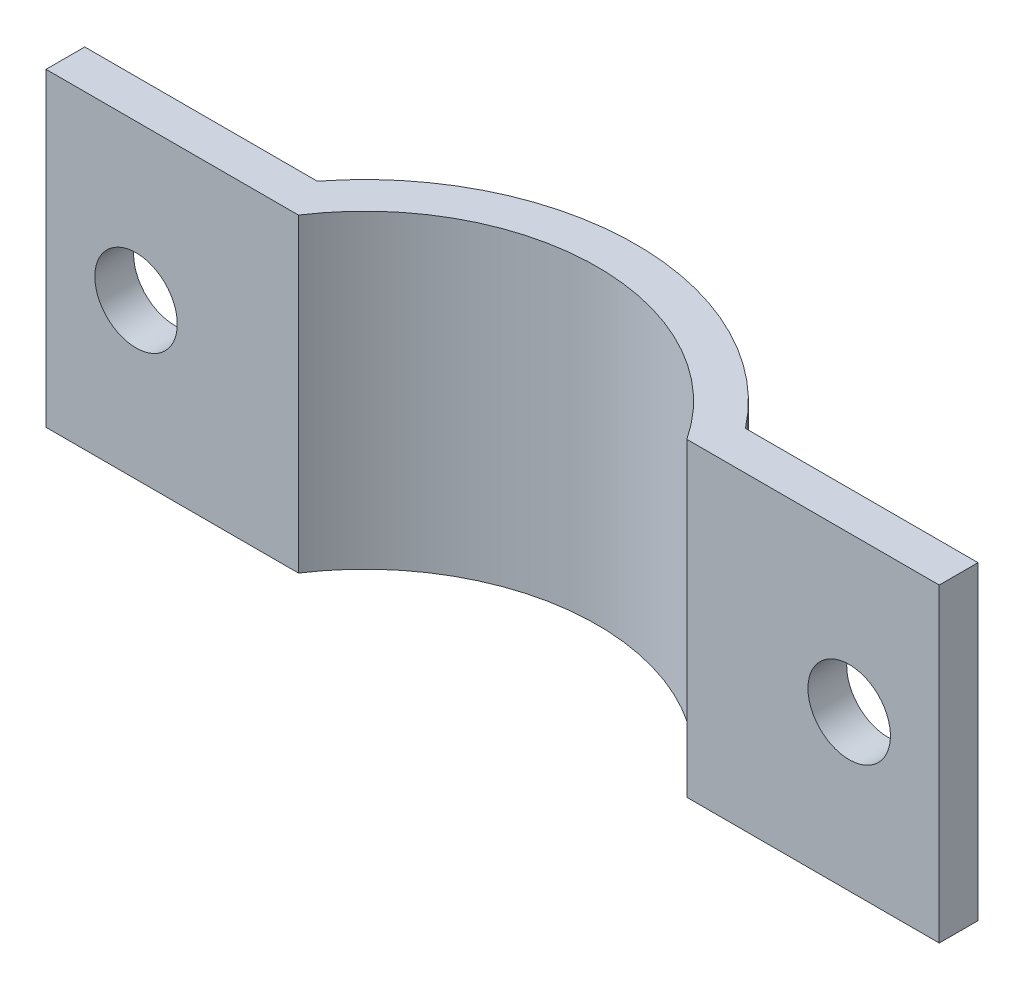
ISO-10303-21;
HEADER;
FILE_DESCRIPTION(('STEP AP214'),'2;1');
FILE_NAME('part.step','',(''),(''),'','','');
FILE_SCHEMA(('AUTOMOTIVE_DESIGN { 1 0 10303 214 1 1 1 1 }'));
ENDSEC;
DATA;
#1=APPLICATION_CONTEXT('core data for automotive mechanical design processes');
#2=APPLICATION_PROTOCOL_DEFINITION('international standard','automotive_design',2000,#1);
#3=PRODUCT_CONTEXT('',#1,'mechanical');
#4=PRODUCT('Part','Part','',(#3));
#5=PRODUCT_RELATED_PRODUCT_CATEGORY('part','',(#4));
#6=PRODUCT_DEFINITION_FORMATION('','',#4);
#7=PRODUCT_DEFINITION_CONTEXT('part definition',#1,'design');
#8=PRODUCT_DEFINITION('design','',#6,#7);
#9=PRODUCT_DEFINITION_SHAPE('','',#8);
#10=(LENGTH_UNIT() NAMED_UNIT(*) SI_UNIT(.MILLI.,.METRE.));
#11=(NAMED_UNIT(*) PLANE_ANGLE_UNIT() SI_UNIT($,.RADIAN.));
#12=(NAMED_UNIT(*) SI_UNIT($,.STERADIAN.) SOLID_ANGLE_UNIT());
#13=UNCERTAINTY_MEASURE_WITH_UNIT(LENGTH_MEASURE(1.E-05),#10,'distance_accuracy_value','');
#14=(GEOMETRIC_REPRESENTATION_CONTEXT(3) GLOBAL_UNCERTAINTY_ASSIGNED_CONTEXT((#13)) GLOBAL_UNIT_ASSIGNED_CONTEXT((#10,
#11,#12)) REPRESENTATION_CONTEXT('',''));
#15=CARTESIAN_POINT('',(0.,0.,0.));
#16=DIRECTION('',(0.,0.,1.));
#17=DIRECTION('',(1.,0.,0.));
#18=AXIS2_PLACEMENT_3D('',#15,#16,#17);
#19=CARTESIAN_POINT('',(0.,25.4,0.));
#20=DIRECTION('',(0.,1.,0.));
#21=DIRECTION('',(0.,0.,1.));
#22=AXIS2_PLACEMENT_3D('',#19,#20,#21);
#23=PLANE('',#22);
#24=DIRECTION('',(-1.,0.,0.));
#25=VECTOR('',#24,1.);
#26=CARTESIAN_POINT('',(42.4748584615149,25.4,-10.4775));
#27=LINE('',#26,#25);
#28=CARTESIAN_POINT('',(36.5873848891447,25.4,-10.4775));
#29=VERTEX_POINT('',#28);
#30=CARTESIAN_POINT('',(15.9098866667868,25.4,-10.4775));
#31=VERTEX_POINT('',#30);
#32=EDGE_CURVE('E56',#29,#31,#27,.T.);
#33=ORIENTED_EDGE('',*,*,#32,.F.);
#34=DIRECTION('',(0.,0.,-1.));
#35=VECTOR('',#34,1.);
#36=CARTESIAN_POINT('',(36.5873848891447,25.4,-13.6525));
#37=LINE('',#36,#35);
#38=CARTESIAN_POINT('',(36.5873848891447,25.4,-13.6525));
#39=VERTEX_POINT('',#38);
#40=EDGE_CURVE('E108',#29,#39,#37,.T.);
#41=ORIENTED_EDGE('',*,*,#40,.T.);
#42=DIRECTION('',(-1.,0.,0.));
#43=VECTOR('',#42,1.);
#44=CARTESIAN_POINT('',(36.5873848891447,25.4,-13.6525));
#45=LINE('',#44,#43);
#46=CARTESIAN_POINT('',(17.5373848891447,25.4,-13.6525));
#47=VERTEX_POINT('',#46);
#48=EDGE_CURVE('E116',#39,#47,#45,.T.);
#49=ORIENTED_EDGE('',*,*,#48,.T.);
#50=CARTESIAN_POINT('',(0.,25.4,0.));
#51=DIRECTION('',(0.,1.,0.));
#52=DIRECTION('',(0.,0.,1.));
#53=AXIS2_PLACEMENT_3D('',#50,#51,#52);
#54=CIRCLE('',#53,22.225);
#55=CARTESIAN_POINT('',(-17.5373848891447,25.4,-13.6525));
#56=VERTEX_POINT('',#55);
#57=EDGE_CURVE('E119',#47,#56,#54,.T.);
#58=ORIENTED_EDGE('',*,*,#57,.T.);
#59=DIRECTION('',(-1.,0.,0.));
#60=VECTOR('',#59,1.);
#61=CARTESIAN_POINT('',(-17.5373848891447,25.4,-13.6525));
#62=LINE('',#61,#60);
#63=CARTESIAN_POINT('',(-36.5873848891447,25.4,-13.6525));
#64=VERTEX_POINT('',#63);
#65=EDGE_CURVE('E129',#56,#64,#62,.T.);
#66=ORIENTED_EDGE('',*,*,#65,.T.);
#67=DIRECTION('',(0.,0.,1.));
#68=VECTOR('',#67,1.);
#69=CARTESIAN_POINT('',(-36.5873848891447,25.4,-13.6525));
#70=LINE('',#69,#68);
#71=CARTESIAN_POINT('',(-36.5873848891447,25.4,-10.4775));
#72=VERTEX_POINT('',#71);
#73=EDGE_CURVE('E131',#64,#72,#70,.T.);
#74=ORIENTED_EDGE('',*,*,#73,.T.);
#75=CARTESIAN_POINT('',(-15.9098866667868,25.4,-10.4775));
#76=VERTEX_POINT('',#75);
#77=EDGE_CURVE('E113',#76,#72,#27,.T.);
#78=ORIENTED_EDGE('',*,*,#77,.F.);
#79=CARTESIAN_POINT('',(0.,25.4,0.));
#80=DIRECTION('',(0.,1.,0.));
#81=DIRECTION('',(0.,0.,1.));
#82=AXIS2_PLACEMENT_3D('',#79,#80,#81);
#83=CIRCLE('',#82,19.05);
#84=EDGE_CURVE('E112',#31,#76,#83,.T.);
#85=ORIENTED_EDGE('',*,*,#84,.F.);
#86=EDGE_LOOP('',(#33,#41,#49,#58,#66,#74,#78,#85));
#87=FACE_BOUND('',#86,.T.);
#88=ADVANCED_FACE('F32',(#87),#23,.T.);
#89=CARTESIAN_POINT('',(0.,0.,0.));
#90=DIRECTION('',(0.,1.,0.));
#91=DIRECTION('',(0.,0.,1.));
#92=AXIS2_PLACEMENT_3D('',#89,#90,#91);
#93=PLANE('',#92);
#94=DIRECTION('',(0.,0.,-1.));
#95=VECTOR('',#94,1.);
#96=CARTESIAN_POINT('',(36.5873848891447,0.,-13.6525));
#97=LINE('',#96,#95);
#98=CARTESIAN_POINT('',(36.5873848891447,0.,-10.4775));
#99=VERTEX_POINT('',#98);
#100=CARTESIAN_POINT('',(36.5873848891447,0.,-13.6525));
#101=VERTEX_POINT('',#100);
#102=EDGE_CURVE('E135',#99,#101,#97,.T.);
#103=ORIENTED_EDGE('',*,*,#102,.F.);
#104=DIRECTION('',(-1.,0.,0.));
#105=VECTOR('',#104,1.);
#106=CARTESIAN_POINT('',(42.4748584615149,0.,-10.4775));
#107=LINE('',#106,#105);
#108=CARTESIAN_POINT('',(15.9098866667868,0.,-10.4775));
#109=VERTEX_POINT('',#108);
#110=EDGE_CURVE('E99',#99,#109,#107,.T.);
#111=ORIENTED_EDGE('',*,*,#110,.T.);
#112=CARTESIAN_POINT('',(0.,0.,0.));
#113=DIRECTION('',(0.,1.,0.));
#114=DIRECTION('',(0.,0.,1.));
#115=AXIS2_PLACEMENT_3D('',#112,#113,#114);
#116=CIRCLE('',#115,19.05);
#117=CARTESIAN_POINT('',(-15.9098866667868,0.,-10.4775));
#118=VERTEX_POINT('',#117);
#119=EDGE_CURVE('E125',#109,#118,#116,.T.);
#120=ORIENTED_EDGE('',*,*,#119,.T.);
#121=CARTESIAN_POINT('',(-36.5873848891447,0.,-10.4775));
#122=VERTEX_POINT('',#121);
#123=EDGE_CURVE('E48',#118,#122,#107,.T.);
#124=ORIENTED_EDGE('',*,*,#123,.T.);
#125=DIRECTION('',(0.,0.,1.));
#126=VECTOR('',#125,1.);
#127=CARTESIAN_POINT('',(-36.5873848891447,0.,-13.6525));
#128=LINE('',#127,#126);
#129=CARTESIAN_POINT('',(-36.5873848891447,0.,-13.6525));
#130=VERTEX_POINT('',#129);
#131=EDGE_CURVE('E117',#130,#122,#128,.T.);
#132=ORIENTED_EDGE('',*,*,#131,.F.);
#133=DIRECTION('',(-1.,0.,0.));
#134=VECTOR('',#133,1.);
#135=CARTESIAN_POINT('',(-17.5373848891447,0.,-13.6525));
#136=LINE('',#135,#134);
#137=CARTESIAN_POINT('',(-17.5373848891447,0.,-13.6525));
#138=VERTEX_POINT('',#137);
#139=EDGE_CURVE('E122',#138,#130,#136,.T.);
#140=ORIENTED_EDGE('',*,*,#139,.F.);
#141=CARTESIAN_POINT('',(0.,0.,0.));
#142=DIRECTION('',(0.,1.,0.));
#143=DIRECTION('',(0.,0.,1.));
#144=AXIS2_PLACEMENT_3D('',#141,#142,#143);
#145=CIRCLE('',#144,22.225);
#146=CARTESIAN_POINT('',(17.5373848891447,0.,-13.6525));
#147=VERTEX_POINT('',#146);
#148=EDGE_CURVE('E139',#147,#138,#145,.T.);
#149=ORIENTED_EDGE('',*,*,#148,.F.);
#150=DIRECTION('',(-1.,0.,0.));
#151=VECTOR('',#150,1.);
#152=CARTESIAN_POINT('',(36.5873848891447,0.,-13.6525));
#153=LINE('',#152,#151);
#154=EDGE_CURVE('E137',#101,#147,#153,.T.);
#155=ORIENTED_EDGE('',*,*,#154,.F.);
#156=EDGE_LOOP('',(#103,#111,#120,#124,#132,#140,#149,#155));
#157=FACE_BOUND('',#156,.T.);
#158=ADVANCED_FACE('F158',(#157),#93,.F.);
#159=CARTESIAN_POINT('',(36.5873848891447,25.4,-13.6525));
#160=DIRECTION('',(-1.,0.,0.));
#161=DIRECTION('',(0.,0.,1.));
#162=AXIS2_PLACEMENT_3D('',#159,#160,#161);
#163=PLANE('',#162);
#164=ORIENTED_EDGE('',*,*,#40,.F.);
#165=DIRECTION('',(0.,-1.,0.));
#166=VECTOR('',#165,1.);
#167=CARTESIAN_POINT('',(36.5873848891447,25.4,-10.4775));
#168=LINE('',#167,#166);
#169=EDGE_CURVE('E96',#29,#99,#168,.T.);
#170=ORIENTED_EDGE('',*,*,#169,.T.);
#171=ORIENTED_EDGE('',*,*,#102,.T.);
#172=DIRECTION('',(0.,-1.,0.));
#173=VECTOR('',#172,1.);
#174=CARTESIAN_POINT('',(36.5873848891447,25.4,-13.6525));
#175=LINE('',#174,#173);
#176=EDGE_CURVE('E11',#39,#101,#175,.T.);
#177=ORIENTED_EDGE('',*,*,#176,.F.);
#178=EDGE_LOOP('',(#164,#170,#171,#177));
#179=FACE_BOUND('',#178,.T.);
#180=ADVANCED_FACE('F34',(#179),#163,.F.);
#181=CARTESIAN_POINT('',(36.5873848891447,25.4,-13.6525));
#182=DIRECTION('',(0.,0.,1.));
#183=DIRECTION('',(1.,0.,0.));
#184=AXIS2_PLACEMENT_3D('',#181,#182,#183);
#185=PLANE('',#184);
#186=CARTESIAN_POINT('',(29.21,12.7,-13.6525));
#187=DIRECTION('',(0.,0.,-1.));
#188=DIRECTION('',(1.,0.,0.));
#189=AXIS2_PLACEMENT_3D('',#186,#187,#188);
#190=CIRCLE('',#189,3.3782);
#191=CARTESIAN_POINT('',(32.5882,12.7,-13.6525));
#192=VERTEX_POINT('',#191);
#193=EDGE_CURVE('E103',#192,#192,#190,.T.);
#194=ORIENTED_EDGE('',*,*,#193,.F.);
#195=EDGE_LOOP('',(#194));
#196=FACE_BOUND('',#195,.T.);
#197=ORIENTED_EDGE('',*,*,#154,.T.);
#198=DIRECTION('',(0.,-1.,0.));
#199=VECTOR('',#198,1.);
#200=CARTESIAN_POINT('',(17.5373848891447,25.4,-13.6525));
#201=LINE('',#200,#199);
#202=EDGE_CURVE('E41',#47,#147,#201,.T.);
#203=ORIENTED_EDGE('',*,*,#202,.F.);
#204=ORIENTED_EDGE('',*,*,#48,.F.);
#205=ORIENTED_EDGE('',*,*,#176,.T.);
#206=EDGE_LOOP('',(#197,#203,#204,#205));
#207=FACE_BOUND('',#206,.T.);
#208=ADVANCED_FACE('F168',(#196,#207),#185,.F.);
#209=CARTESIAN_POINT('',(0.,25.4,0.));
#210=DIRECTION('',(0.,-1.,0.));
#211=DIRECTION('',(0.,0.,-1.));
#212=AXIS2_PLACEMENT_3D('',#209,#210,#211);
#213=CYLINDRICAL_SURFACE('',#212,22.225);
#214=ORIENTED_EDGE('',*,*,#148,.T.);
#215=DIRECTION('',(0.,-1.,0.));
#216=VECTOR('',#215,1.);
#217=CARTESIAN_POINT('',(-17.5373848891447,25.4,-13.6525));
#218=LINE('',#217,#216);
#219=EDGE_CURVE('E144',#56,#138,#218,.T.);
#220=ORIENTED_EDGE('',*,*,#219,.F.);
#221=ORIENTED_EDGE('',*,*,#57,.F.);
#222=ORIENTED_EDGE('',*,*,#202,.T.);
#223=EDGE_LOOP('',(#214,#220,#221,#222));
#224=FACE_BOUND('',#223,.T.);
#225=ADVANCED_FACE('F152',(#224),#213,.T.);
#226=CARTESIAN_POINT('',(-17.5373848891447,25.4,-13.6525));
#227=DIRECTION('',(0.,0.,1.));
#228=DIRECTION('',(1.,0.,0.));
#229=AXIS2_PLACEMENT_3D('',#226,#227,#228);
#230=PLANE('',#229);
#231=CARTESIAN_POINT('',(-29.21,12.7,-13.6525));
#232=DIRECTION('',(0.,0.,-1.));
#233=DIRECTION('',(-1.,0.,0.));
#234=AXIS2_PLACEMENT_3D('',#231,#232,#233);
#235=CIRCLE('',#234,3.3782);
#236=CARTESIAN_POINT('',(-32.5882,12.7,-13.6525));
#237=VERTEX_POINT('',#236);
#238=EDGE_CURVE('E195',#237,#237,#235,.T.);
#239=ORIENTED_EDGE('',*,*,#238,.F.);
#240=EDGE_LOOP('',(#239));
#241=FACE_BOUND('',#240,.T.);
#242=ORIENTED_EDGE('',*,*,#139,.T.);
#243=DIRECTION('',(0.,-1.,0.));
#244=VECTOR('',#243,1.);
#245=CARTESIAN_POINT('',(-36.5873848891447,25.4,-13.6525));
#246=LINE('',#245,#244);
#247=EDGE_CURVE('E134',#64,#130,#246,.T.);
#248=ORIENTED_EDGE('',*,*,#247,.F.);
#249=ORIENTED_EDGE('',*,*,#65,.F.);
#250=ORIENTED_EDGE('',*,*,#219,.T.);
#251=EDGE_LOOP('',(#242,#248,#249,#250));
#252=FACE_BOUND('',#251,.T.);
#253=ADVANCED_FACE('F162',(#241,#252),#230,.F.);
#254=CARTESIAN_POINT('',(-36.5873848891447,25.4,-13.6525));
#255=DIRECTION('',(1.,0.,0.));
#256=DIRECTION('',(0.,0.,-1.));
#257=AXIS2_PLACEMENT_3D('',#254,#255,#256);
#258=PLANE('',#257);
#259=ORIENTED_EDGE('',*,*,#131,.T.);
#260=DIRECTION('',(0.,1.,0.));
#261=VECTOR('',#260,1.);
#262=CARTESIAN_POINT('',(-36.5873848891447,25.4,-10.4775));
#263=LINE('',#262,#261);
#264=EDGE_CURVE('E104',#122,#72,#263,.T.);
#265=ORIENTED_EDGE('',*,*,#264,.T.);
#266=ORIENTED_EDGE('',*,*,#73,.F.);
#267=ORIENTED_EDGE('',*,*,#247,.T.);
#268=EDGE_LOOP('',(#259,#265,#266,#267));
#269=FACE_BOUND('',#268,.T.);
#270=ADVANCED_FACE('F166',(#269),#258,.F.);
#271=CARTESIAN_POINT('',(0.,25.4,0.));
#272=DIRECTION('',(0.,-1.,0.));
#273=DIRECTION('',(0.,0.,-1.));
#274=AXIS2_PLACEMENT_3D('',#271,#272,#273);
#275=CYLINDRICAL_SURFACE('',#274,19.05);
#276=DIRECTION('',(0.,-1.,0.));
#277=VECTOR('',#276,1.);
#278=CARTESIAN_POINT('',(15.9098866667868,25.4,-10.4775));
#279=LINE('',#278,#277);
#280=EDGE_CURVE('E205',#31,#109,#279,.T.);
#281=ORIENTED_EDGE('',*,*,#280,.F.);
#282=ORIENTED_EDGE('',*,*,#84,.T.);
#283=DIRECTION('',(0.,-1.,0.));
#284=VECTOR('',#283,1.);
#285=CARTESIAN_POINT('',(-15.9098866667868,25.4,-10.4775));
#286=LINE('',#285,#284);
#287=EDGE_CURVE('E204',#118,#76,#286,.F.);
#288=ORIENTED_EDGE('',*,*,#287,.F.);
#289=ORIENTED_EDGE('',*,*,#119,.F.);
#290=EDGE_LOOP('',(#281,#282,#288,#289));
#291=FACE_BOUND('',#290,.T.);
#292=ADVANCED_FACE('F184',(#291),#275,.F.);
#293=CARTESIAN_POINT('',(-29.21,12.7,22.225));
#294=DIRECTION('',(0.,0.,-1.));
#295=DIRECTION('',(-1.,0.,0.));
#296=AXIS2_PLACEMENT_3D('',#293,#294,#295);
#297=CYLINDRICAL_SURFACE('',#296,3.3782);
#298=CARTESIAN_POINT('',(-29.21,12.7,-10.4775));
#299=DIRECTION('',(0.,0.,-1.));
#300=DIRECTION('',(-1.,0.,0.));
#301=AXIS2_PLACEMENT_3D('',#298,#299,#300);
#302=CIRCLE('',#301,3.3782);
#303=CARTESIAN_POINT('',(-32.5882,12.7,-10.4775));
#304=VERTEX_POINT('',#303);
#305=EDGE_CURVE('E207',#304,#304,#302,.F.);
#306=ORIENTED_EDGE('',*,*,#305,.T.);
#307=EDGE_LOOP('',(#306));
#308=FACE_BOUND('',#307,.T.);
#309=ORIENTED_EDGE('',*,*,#238,.T.);
#310=EDGE_LOOP('',(#309));
#311=FACE_BOUND('',#310,.T.);
#312=ADVANCED_FACE('F226',(#308,#311),#297,.F.);
#313=CARTESIAN_POINT('',(29.21,12.7,22.225));
#314=DIRECTION('',(0.,0.,-1.));
#315=DIRECTION('',(-1.,0.,0.));
#316=AXIS2_PLACEMENT_3D('',#313,#314,#315);
#317=CYLINDRICAL_SURFACE('',#316,3.3782);
#318=CARTESIAN_POINT('',(29.21,12.7,-10.4775));
#319=DIRECTION('',(0.,0.,-1.));
#320=DIRECTION('',(-1.,0.,0.));
#321=AXIS2_PLACEMENT_3D('',#318,#319,#320);
#322=CIRCLE('',#321,3.3782);
#323=CARTESIAN_POINT('',(25.8318,12.7,-10.4775));
#324=VERTEX_POINT('',#323);
#325=EDGE_CURVE('E36',#324,#324,#322,.F.);
#326=ORIENTED_EDGE('',*,*,#325,.T.);
#327=EDGE_LOOP('',(#326));
#328=FACE_BOUND('',#327,.T.);
#329=ORIENTED_EDGE('',*,*,#193,.T.);
#330=EDGE_LOOP('',(#329));
#331=FACE_BOUND('',#330,.T.);
#332=ADVANCED_FACE('F215',(#328,#331),#317,.F.);
#333=CARTESIAN_POINT('',(42.4748584615149,0.,-10.4775));
#334=DIRECTION('',(0.,0.,-1.));
#335=DIRECTION('',(-1.,0.,0.));
#336=AXIS2_PLACEMENT_3D('',#333,#334,#335);
#337=PLANE('',#336);
#338=ORIENTED_EDGE('',*,*,#325,.F.);
#339=EDGE_LOOP('',(#338));
#340=FACE_BOUND('',#339,.T.);
#341=ORIENTED_EDGE('',*,*,#32,.T.);
#342=ORIENTED_EDGE('',*,*,#280,.T.);
#343=ORIENTED_EDGE('',*,*,#110,.F.);
#344=ORIENTED_EDGE('',*,*,#169,.F.);
#345=EDGE_LOOP('',(#341,#342,#343,#344));
#346=FACE_BOUND('',#345,.T.);
#347=ADVANCED_FACE('F97',(#340,#346),#337,.F.);
#348=ORIENTED_EDGE('',*,*,#305,.F.);
#349=EDGE_LOOP('',(#348));
#350=FACE_BOUND('',#349,.T.);
#351=ORIENTED_EDGE('',*,*,#123,.F.);
#352=ORIENTED_EDGE('',*,*,#287,.T.);
#353=ORIENTED_EDGE('',*,*,#77,.T.);
#354=ORIENTED_EDGE('',*,*,#264,.F.);
#355=EDGE_LOOP('',(#351,#352,#353,#354));
#356=FACE_BOUND('',#355,.T.);
#357=ADVANCED_FACE('F219',(#350,#356),#337,.F.);
#358=CLOSED_SHELL('',(#88,#158,#180,#208,#225,#253,#270,#292,#312,#332,#347,#357));
#359=MANIFOLD_SOLID_BREP('B2',#358);
#360=ADVANCED_BREP_SHAPE_REPRESENTATION('',(#18,#359),#14);
#361=SHAPE_DEFINITION_REPRESENTATION(#9,#360);
ENDSEC;
END-ISO-10303-21;
